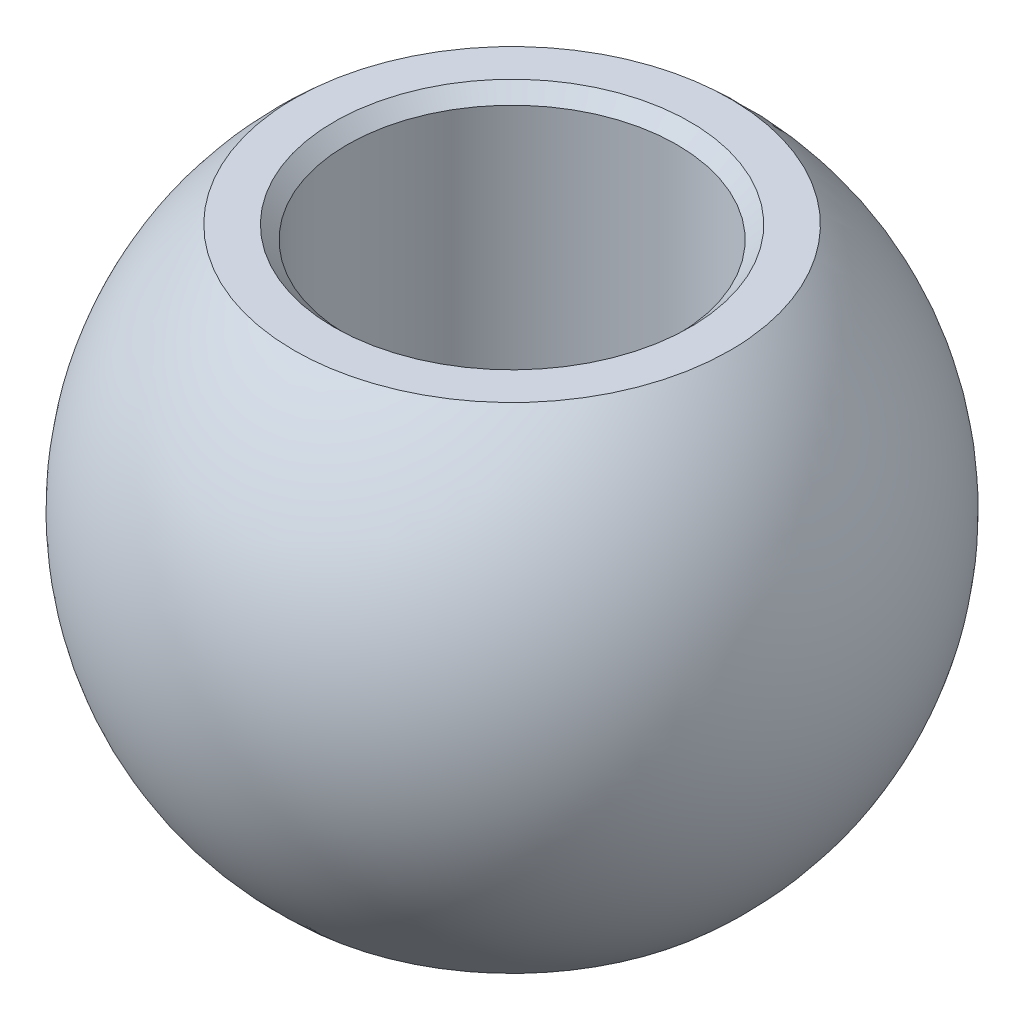
ISO-10303-21;
HEADER;
FILE_DESCRIPTION(('STEP AP214'),'2;1');
FILE_NAME('part.step','',(''),(''),'','','');
FILE_SCHEMA(('AUTOMOTIVE_DESIGN { 1 0 10303 214 1 1 1 1 }'));
ENDSEC;
DATA;
#1=APPLICATION_CONTEXT('core data for automotive mechanical design processes');
#2=APPLICATION_PROTOCOL_DEFINITION('international standard','automotive_design',2000,#1);
#3=PRODUCT_CONTEXT('',#1,'mechanical');
#4=PRODUCT('Part','Part','',(#3));
#5=PRODUCT_RELATED_PRODUCT_CATEGORY('part','',(#4));
#6=PRODUCT_DEFINITION_FORMATION('','',#4);
#7=PRODUCT_DEFINITION_CONTEXT('part definition',#1,'design');
#8=PRODUCT_DEFINITION('design','',#6,#7);
#9=PRODUCT_DEFINITION_SHAPE('','',#8);
#10=(LENGTH_UNIT() NAMED_UNIT(*) SI_UNIT(.MILLI.,.METRE.));
#11=(NAMED_UNIT(*) PLANE_ANGLE_UNIT() SI_UNIT($,.RADIAN.));
#12=(NAMED_UNIT(*) SI_UNIT($,.STERADIAN.) SOLID_ANGLE_UNIT());
#13=UNCERTAINTY_MEASURE_WITH_UNIT(LENGTH_MEASURE(1.E-05),#10,'distance_accuracy_value','');
#14=(GEOMETRIC_REPRESENTATION_CONTEXT(3) GLOBAL_UNCERTAINTY_ASSIGNED_CONTEXT((#13)) GLOBAL_UNIT_ASSIGNED_CONTEXT((#10,
#11,#12)) REPRESENTATION_CONTEXT('',''));
#15=CARTESIAN_POINT('',(0.,0.,0.));
#16=DIRECTION('',(0.,0.,1.));
#17=DIRECTION('',(1.,0.,0.));
#18=AXIS2_PLACEMENT_3D('',#15,#16,#17);
#19=CARTESIAN_POINT('',(0.,0.,39.6748));
#20=DIRECTION('',(0.,1.,0.));
#21=DIRECTION('',(0.,0.,1.));
#22=AXIS2_PLACEMENT_3D('',#19,#20,#21);
#23=CYLINDRICAL_SURFACE('',#22,3.175);
#24=CARTESIAN_POINT('',(0.,-4.50849999998582,39.6748));
#25=DIRECTION('',(0.,-1.,0.));
#26=DIRECTION('',(0.,0.,-1.));
#27=AXIS2_PLACEMENT_3D('',#24,#25,#26);
#28=CIRCLE('',#27,3.17499999994174);
#29=CARTESIAN_POINT('',(0.,-4.50849999998582,36.4998000000583));
#30=VERTEX_POINT('',#29);
#31=EDGE_CURVE('E55',#30,#30,#28,.T.);
#32=ORIENTED_EDGE('',*,*,#31,.T.);
#33=EDGE_LOOP('',(#32));
#34=FACE_BOUND('',#33,.T.);
#35=CARTESIAN_POINT('',(0.,4.50849999998582,39.6748));
#36=DIRECTION('',(0.,1.,0.));
#37=DIRECTION('',(0.,0.,-1.));
#38=AXIS2_PLACEMENT_3D('',#35,#36,#37);
#39=CIRCLE('',#38,3.17499999994174);
#40=CARTESIAN_POINT('',(0.,4.50849999998582,36.4998000000583));
#41=VERTEX_POINT('',#40);
#42=EDGE_CURVE('E52',#41,#41,#39,.T.);
#43=ORIENTED_EDGE('',*,*,#42,.T.);
#44=EDGE_LOOP('',(#43));
#45=FACE_BOUND('',#44,.T.);
#46=ADVANCED_FACE('F16',(#34,#45),#23,.F.);
#47=CARTESIAN_POINT('',(0.,-4.76250000014034,39.6748));
#48=DIRECTION('',(0.,-1.,0.));
#49=DIRECTION('',(1.,0.,0.));
#50=AXIS2_PLACEMENT_3D('',#47,#48,#49);
#51=CONICAL_SURFACE('',#50,3.42900000009626,0.785398163397448);
#52=ORIENTED_EDGE('',*,*,#31,.F.);
#53=EDGE_LOOP('',(#52));
#54=FACE_BOUND('',#53,.T.);
#55=CARTESIAN_POINT('',(0.,-4.76250000002665,39.6748));
#56=DIRECTION('',(0.,-1.,0.));
#57=DIRECTION('',(1.,0.,0.));
#58=AXIS2_PLACEMENT_3D('',#55,#56,#57);
#59=CIRCLE('',#58,3.42899999998257);
#60=CARTESIAN_POINT('',(3.42899999998257,-4.76250000002665,39.6748));
#61=VERTEX_POINT('',#60);
#62=EDGE_CURVE('E19',#61,#61,#59,.T.);
#63=ORIENTED_EDGE('',*,*,#62,.T.);
#64=EDGE_LOOP('',(#63));
#65=FACE_BOUND('',#64,.T.);
#66=ADVANCED_FACE('F69',(#54,#65),#51,.F.);
#67=CARTESIAN_POINT('',(0.,4.76250000014034,39.6748));
#68=DIRECTION('',(0.,1.,0.));
#69=DIRECTION('',(0.,0.,1.));
#70=AXIS2_PLACEMENT_3D('',#67,#68,#69);
#71=CONICAL_SURFACE('',#70,3.42900000009626,0.785398163397448);
#72=ORIENTED_EDGE('',*,*,#42,.F.);
#73=EDGE_LOOP('',(#72));
#74=FACE_BOUND('',#73,.T.);
#75=CARTESIAN_POINT('',(0.,4.76250000002665,39.6748));
#76=DIRECTION('',(0.,1.,0.));
#77=DIRECTION('',(0.,0.,1.));
#78=AXIS2_PLACEMENT_3D('',#75,#76,#77);
#79=CIRCLE('',#78,3.42899999998257);
#80=CARTESIAN_POINT('',(0.,4.76250000002665,43.1037999999826));
#81=VERTEX_POINT('',#80);
#82=EDGE_CURVE('E62',#81,#81,#79,.T.);
#83=ORIENTED_EDGE('',*,*,#82,.T.);
#84=EDGE_LOOP('',(#83));
#85=FACE_BOUND('',#84,.T.);
#86=ADVANCED_FACE('F66',(#74,#85),#71,.F.);
#87=CARTESIAN_POINT('',(0.,-4.7625,39.6748));
#88=DIRECTION('',(0.,1.,0.));
#89=DIRECTION('',(-1.,0.,0.));
#90=AXIS2_PLACEMENT_3D('',#87,#88,#89);
#91=PLANE('',#90);
#92=CARTESIAN_POINT('',(0.,-4.7625,35.474669793685));
#93=CARTESIAN_POINT('',(-0.117926484560648,-4.76249999999999,35.4746705003406));
#94=CARTESIAN_POINT('',(-0.235874641254157,-4.7625,35.4796407426249));
#95=CARTESIAN_POINT('',(-0.470955861004179,-4.7625,35.4994893992508));
#96=CARTESIAN_POINT('',(-0.588088673100279,-4.76249999999999,35.5143707387952));
#97=CARTESIAN_POINT('',(-0.820881455214078,-4.76250000000001,35.5539746348211));
#98=CARTESIAN_POINT('',(-0.936538785047825,-4.76250000000002,35.578712813112));
#99=CARTESIAN_POINT('',(-1.16542262835762,-4.76249999999998,35.6378598749722));
#100=CARTESIAN_POINT('',(-1.27864708861528,-4.76249999999992,35.6722766063815));
#101=CARTESIAN_POINT('',(-1.61297348901639,-4.76249999999987,35.7895687284957));
#102=CARTESIAN_POINT('',(-1.82929109201931,-4.7625,35.8865823893113));
#103=CARTESIAN_POINT('',(-2.24254482911471,-4.7625,36.1156012463159));
#104=CARTESIAN_POINT('',(-2.43948022604495,-4.76249999999986,36.2476077726817));
#105=CARTESIAN_POINT('',(-2.71606737206159,-4.76249999999991,36.4688554348013));
#106=CARTESIAN_POINT('',(-2.80517919807279,-4.76249999999998,36.5465360472166));
#107=CARTESIAN_POINT('',(-2.97648149360179,-4.76250000000002,36.7090689827918));
#108=CARTESIAN_POINT('',(-3.05867855351256,-4.76250000000001,36.7939143191315));
#109=CARTESIAN_POINT('',(-3.21566582479756,-4.76249999999999,36.9702602153388));
#110=CARTESIAN_POINT('',(-3.29045266406455,-4.7625,37.0617637725565));
#111=CARTESIAN_POINT('',(-3.43207083285623,-4.7625,37.2507683469001));
#112=CARTESIAN_POINT('',(-3.49890031578299,-4.7625,37.3482707481971));
#113=CARTESIAN_POINT('',(-3.62408488645374,-4.7625,37.5485259987615));
#114=CARTESIAN_POINT('',(-3.68244282868451,-4.7625,37.6512770636412));
#115=CARTESIAN_POINT('',(-3.79031685235154,-4.7625,37.8613661013462));
#116=CARTESIAN_POINT('',(-3.83982966775091,-4.7625,37.9687057504367));
#117=CARTESIAN_POINT('',(-3.92961805965568,-4.7625,38.1871414385288));
#118=CARTESIAN_POINT('',(-3.96989715669365,-4.7625,38.298236027288));
#119=CARTESIAN_POINT('',(-4.04096740989927,-4.7625,38.5234351936217));
#120=CARTESIAN_POINT('',(-4.07175500997035,-4.7625,38.637540881999));
#121=CARTESIAN_POINT('',(-4.14948264836218,-4.7625,38.9830616747164));
#122=CARTESIAN_POINT('',(-4.18188464233577,-4.7625,39.2179174453362));
#123=CARTESIAN_POINT('',(-4.20674194830698,-4.7625,39.6897335499569));
#124=CARTESIAN_POINT('',(-4.19919726030459,-4.7625,39.9266938839578));
#125=CARTESIAN_POINT('',(-4.15820619108129,-4.7625,40.2784692898831));
#126=CARTESIAN_POINT('',(-4.13957890770972,-4.7625,40.3951783673039));
#127=CARTESIAN_POINT('',(-4.09256533770935,-4.7625,40.6265986983984));
#128=CARTESIAN_POINT('',(-4.06418270421069,-4.7625,40.741310683062));
#129=CARTESIAN_POINT('',(-3.9978439316288,-4.7625,40.9679718231047));
#130=CARTESIAN_POINT('',(-3.95988413911528,-4.7625,41.0799199061967));
#131=CARTESIAN_POINT('',(-3.87468281446519,-4.7625,41.3001809854272));
#132=CARTESIAN_POINT('',(-3.8274447064219,-4.7625,41.408495305366));
#133=CARTESIAN_POINT('',(-3.72399535984847,-4.7625,41.6207959761284));
#134=CARTESIAN_POINT('',(-3.66778109513567,-4.7625,41.7247808523832));
#135=CARTESIAN_POINT('',(-3.54680693840993,-4.7625,41.9276199222372));
#136=CARTESIAN_POINT('',(-3.4820490282168,-4.7625,42.0264752983098));
#137=CARTESIAN_POINT('',(-3.34446071544949,-4.7625,42.2183407059385));
#138=CARTESIAN_POINT('',(-3.2716339812673,-4.7625,42.3113533639208));
#139=CARTESIAN_POINT('',(-3.11835846692699,-4.7625,42.4909864574862));
#140=CARTESIAN_POINT('',(-3.03790239870583,-4.7625,42.5776006374261));
#141=CARTESIAN_POINT('',(-2.78609444631246,-4.76250000000001,42.8266864307715));
#142=CARTESIAN_POINT('',(-2.60412011062188,-4.7625,42.9786555549948));
#143=CARTESIAN_POINT('',(-2.21721871431334,-4.7625,43.2498300331846));
#144=CARTESIAN_POINT('',(-2.01229252654771,-4.7625,43.3690366325053));
#145=CARTESIAN_POINT('',(-1.69214162632159,-4.7625,43.5208094396865));
#146=CARTESIAN_POINT('',(-1.58316037186445,-4.7625,43.5669329258782));
#147=CARTESIAN_POINT('',(-1.36175860205062,-4.7625,43.6498029746188));
#148=CARTESIAN_POINT('',(-1.2493409531731,-4.7625,43.6865571258167));
#149=CARTESIAN_POINT('',(-1.02199834753082,-4.7625,43.7504029373041));
#150=CARTESIAN_POINT('',(-0.907077657826514,-4.7625,43.7775098554997));
#151=CARTESIAN_POINT('',(-0.675383462532599,-4.7625,43.821950252844));
#152=CARTESIAN_POINT('',(-0.558610513885534,-4.7625,43.8392866146316));
#153=CARTESIAN_POINT('',(-0.368047147367473,-4.7625,43.8594230565356));
#154=CARTESIAN_POINT('',(-0.294561834944463,-4.7625,43.8652363974709));
#155=CARTESIAN_POINT('',(-0.147387169762454,-4.7625,43.8729901931718));
#156=CARTESIAN_POINT('',(-0.0736978170034557,-4.7625,43.8749306479375));
#157=CARTESIAN_POINT('',(0.117926484560645,-4.7625,43.8749294996594));
#158=CARTESIAN_POINT('',(0.235874641254155,-4.7625,43.8699592573751));
#159=CARTESIAN_POINT('',(0.470955861004177,-4.7625,43.8501106007492));
#160=CARTESIAN_POINT('',(0.588088673100276,-4.76249999999999,43.8352292612048));
#161=CARTESIAN_POINT('',(0.820881455214074,-4.76250000000001,43.7956253651789));
#162=CARTESIAN_POINT('',(0.936538785047819,-4.76250000000002,43.770887186888));
#163=CARTESIAN_POINT('',(1.16542262835762,-4.76249999999998,43.7117401250278));
#164=CARTESIAN_POINT('',(1.27864708861528,-4.76249999999992,43.6773233936185));
#165=CARTESIAN_POINT('',(1.61297348901639,-4.76249999999987,43.5600312715043));
#166=CARTESIAN_POINT('',(1.8292910920193,-4.7625,43.4630176106887));
#167=CARTESIAN_POINT('',(2.2425448291147,-4.7625,43.2339987536841));
#168=CARTESIAN_POINT('',(2.43948022604494,-4.76249999999987,43.1019922273183));
#169=CARTESIAN_POINT('',(2.71606737206159,-4.76249999999992,42.8807445651986));
#170=CARTESIAN_POINT('',(2.8051791980728,-4.76249999999998,42.8030639527834));
#171=CARTESIAN_POINT('',(2.97648149360179,-4.76250000000002,42.6405310172082));
#172=CARTESIAN_POINT('',(3.05867855351256,-4.76250000000001,42.5556856808685));
#173=CARTESIAN_POINT('',(3.21566582479755,-4.76249999999999,42.3793397846612));
#174=CARTESIAN_POINT('',(3.29045266406455,-4.7625,42.2878362274435));
#175=CARTESIAN_POINT('',(3.43207083285622,-4.7625,42.0988316530999));
#176=CARTESIAN_POINT('',(3.49890031578299,-4.7625,42.0013292518029));
#177=CARTESIAN_POINT('',(3.62408488645374,-4.7625,41.8010740012385));
#178=CARTESIAN_POINT('',(3.68244282868451,-4.7625,41.6983229363588));
#179=CARTESIAN_POINT('',(3.79031685235154,-4.7625,41.4882338986538));
#180=CARTESIAN_POINT('',(3.8398296677509,-4.7625,41.3808942495633));
#181=CARTESIAN_POINT('',(3.92961805965568,-4.7625,41.1624585614712));
#182=CARTESIAN_POINT('',(3.96989715669365,-4.7625,41.051363972712));
#183=CARTESIAN_POINT('',(4.04096740989927,-4.7625,40.8261648063783));
#184=CARTESIAN_POINT('',(4.07175500997035,-4.7625,40.712059118001));
#185=CARTESIAN_POINT('',(4.14948264836218,-4.7625,40.3665383252836));
#186=CARTESIAN_POINT('',(4.18188464233577,-4.7625,40.1316825546638));
#187=CARTESIAN_POINT('',(4.20674194830697,-4.7625,39.6598664500431));
#188=CARTESIAN_POINT('',(4.19919726030459,-4.7625,39.4229061160422));
#189=CARTESIAN_POINT('',(4.15820619108129,-4.7625,39.0711307101168));
#190=CARTESIAN_POINT('',(4.13957890770973,-4.7625,38.9544216326961));
#191=CARTESIAN_POINT('',(4.09256533770935,-4.7625,38.7230013016016));
#192=CARTESIAN_POINT('',(4.06418270421069,-4.7625,38.608289316938));
#193=CARTESIAN_POINT('',(3.9978439316288,-4.7625,38.3816281768953));
#194=CARTESIAN_POINT('',(3.95988413911527,-4.7625,38.2696800938033));
#195=CARTESIAN_POINT('',(3.87468281446518,-4.7625,38.0494190145728));
#196=CARTESIAN_POINT('',(3.8274447064219,-4.7625,37.941104694634));
#197=CARTESIAN_POINT('',(3.72399535984847,-4.7625,37.7288040238715));
#198=CARTESIAN_POINT('',(3.66778109513566,-4.7625,37.6248191476168));
#199=CARTESIAN_POINT('',(3.54680693840993,-4.7625,37.4219800777628));
#200=CARTESIAN_POINT('',(3.48204902821679,-4.7625,37.3231247016902));
#201=CARTESIAN_POINT('',(3.34446071544948,-4.7625,37.1312592940615));
#202=CARTESIAN_POINT('',(3.2716339812673,-4.7625,37.0382466360792));
#203=CARTESIAN_POINT('',(3.11835846692699,-4.7625,36.8586135425138));
#204=CARTESIAN_POINT('',(3.03790239870582,-4.7625,36.7719993625739));
#205=CARTESIAN_POINT('',(2.78609444631245,-4.7625,36.5229135692285));
#206=CARTESIAN_POINT('',(2.60412011062188,-4.7625,36.3709444450052));
#207=CARTESIAN_POINT('',(2.21721871431334,-4.7625,36.0997699668154));
#208=CARTESIAN_POINT('',(2.0122925265477,-4.7625,35.9805633674946));
#209=CARTESIAN_POINT('',(1.69214162632159,-4.7625,35.8287905603135));
#210=CARTESIAN_POINT('',(1.58316037186444,-4.7625,35.7826670741218));
#211=CARTESIAN_POINT('',(1.36175860205061,-4.7625,35.6997970253812));
#212=CARTESIAN_POINT('',(1.2493409531731,-4.7625,35.6630428741833));
#213=CARTESIAN_POINT('',(1.02199834753082,-4.7625,35.5991970626959));
#214=CARTESIAN_POINT('',(0.907077657826514,-4.7625,35.5720901445003));
#215=CARTESIAN_POINT('',(0.6753834625326,-4.7625,35.527649747156));
#216=CARTESIAN_POINT('',(0.558610513885536,-4.7625,35.5103133853683));
#217=CARTESIAN_POINT('',(0.368047147367474,-4.7625,35.4901769434644));
#218=CARTESIAN_POINT('',(0.294561834944463,-4.7625,35.4843636025291));
#219=CARTESIAN_POINT('',(0.147387169762453,-4.7625,35.4766098068282));
#220=CARTESIAN_POINT('',(0.0736978170034544,-4.7625,35.4746693520625));
#221=CARTESIAN_POINT('',(0.,-4.7625,35.474669793685));
#222=B_SPLINE_CURVE_WITH_KNOTS('',3,(#92,#93,#94,#95,#96,#97,#98,#99,#100,#101,#102,#103,#104,
#105,#106,#107,#108,#109,#110,#111,#112,#113,#114,#115,#116,#117,#118,#119,#120,#121,#122,#123,
#124,#125,#126,#127,#128,#129,#130,#131,#132,#133,#134,#135,#136,#137,#138,#139,#140,#141,#142,
#143,#144,#145,#146,#147,#148,#149,#150,#151,#152,#153,#154,#155,#156,#157,#158,#159,#160,#161,
#162,#163,#164,#165,#166,#167,#168,#169,#170,#171,#172,#173,#174,#175,#176,#177,#178,#179,#180,
#181,#182,#183,#184,#185,#186,#187,#188,#189,#190,#191,#192,#193,#194,#195,#196,#197,#198,#199,
#200,#201,#202,#203,#204,#205,#206,#207,#208,#209,#210,#211,#212,#213,#214,#215,#216,#217,#218,
#219,#220,#221),.UNSPECIFIED.,.T.,.F.,(4,2,2,2,2,2,2,2,2,2,2,2,2,2,2,2,2,2,2,2,2,2,2,2,2,2,2,2,
2,2,2,2,2,2,2,2,2,2,2,2,2,2,2,2,2,2,2,2,2,2,2,2,2,2,2,2,2,2,2,2,2,2,2,2,4),(0.,
0.353711607909458,0.707527658036068,1.0619067054432,1.41657393321626,2.12421773198893,
2.83188843414218,3.1861874417149,3.54014485168142,3.89426260138645,4.24846236876854,
4.60254251007931,4.95675312540428,5.31082846567946,5.66503630351361,6.37269355397748,
7.08035080444135,7.43455864227549,7.78863398255066,8.14284459787563,8.4969247391864,
8.85112450656849,9.20524225627352,9.55919966624004,9.91349867381277,10.621169375966,
11.3288131747387,11.6834804025117,12.0378594499189,12.3916755000455,12.745387107955,
12.9664381589451,13.1874892099353,13.5412008178448,13.8950168679714,14.2493959153785,
14.6040631431516,15.3117069419242,16.0193776440775,16.3736766516502,16.7276340616168,
17.0817518113218,17.4359515787039,17.7900317200146,18.1442423353396,18.4983176756148,
18.8525255134489,19.5601827639128,20.2678400143767,20.6220478522108,20.976123192486,
21.330333807811,21.6844139491217,22.0386137165038,22.3927314662088,22.7466888761754,
23.1009878837481,23.8086585859014,24.516302384674,24.8709696124471,25.2253486598542,
25.5791647099808,25.9328763178903,26.1539273688805,26.3749784198707),.UNSPECIFIED.);
#223=CARTESIAN_POINT('',(0.,-4.7625,35.474669793685));
#224=VERTEX_POINT('',#223);
#225=EDGE_CURVE('E25',#224,#224,#222,.T.);
#226=ORIENTED_EDGE('',*,*,#225,.F.);
#227=EDGE_LOOP('',(#226));
#228=FACE_BOUND('',#227,.T.);
#229=ORIENTED_EDGE('',*,*,#62,.F.);
#230=EDGE_LOOP('',(#229));
#231=FACE_BOUND('',#230,.T.);
#232=ADVANCED_FACE('F40',(#228,#231),#91,.F.);
#233=CARTESIAN_POINT('',(0.,4.7625,39.6748));
#234=DIRECTION('',(0.,-1.,0.));
#235=DIRECTION('',(0.,0.,-1.));
#236=AXIS2_PLACEMENT_3D('',#233,#234,#235);
#237=PLANE('',#236);
#238=CARTESIAN_POINT('',(0.,4.7625,43.874930206315));
#239=CARTESIAN_POINT('',(-0.117926484560646,4.7625,43.8749294996594));
#240=CARTESIAN_POINT('',(-0.235874641254156,4.7625,43.8699592573751));
#241=CARTESIAN_POINT('',(-0.470955861004178,4.7625,43.8501106007492));
#242=CARTESIAN_POINT('',(-0.588088673100278,4.76249999999999,43.8352292612048));
#243=CARTESIAN_POINT('',(-0.820881455214076,4.76250000000001,43.7956253651789));
#244=CARTESIAN_POINT('',(-0.936538785047821,4.76250000000002,43.770887186888));
#245=CARTESIAN_POINT('',(-1.16542262835762,4.76249999999998,43.7117401250278));
#246=CARTESIAN_POINT('',(-1.27864708861528,4.76249999999992,43.6773233936185));
#247=CARTESIAN_POINT('',(-1.61297348901639,4.76249999999987,43.5600312715043));
#248=CARTESIAN_POINT('',(-1.8292910920193,4.7625,43.4630176106887));
#249=CARTESIAN_POINT('',(-2.2425448291147,4.7625,43.2339987536841));
#250=CARTESIAN_POINT('',(-2.43948022604495,4.76249999999986,43.1019922273183));
#251=CARTESIAN_POINT('',(-2.71606737206159,4.76249999999992,42.8807445651986));
#252=CARTESIAN_POINT('',(-2.80517919807279,4.76249999999998,42.8030639527834));
#253=CARTESIAN_POINT('',(-2.97648149360178,4.76250000000002,42.6405310172082));
#254=CARTESIAN_POINT('',(-3.05867855351256,4.76250000000001,42.5556856808685));
#255=CARTESIAN_POINT('',(-3.21566582479756,4.76249999999999,42.3793397846612));
#256=CARTESIAN_POINT('',(-3.29045266406455,4.7625,42.2878362274435));
#257=CARTESIAN_POINT('',(-3.43207083285622,4.7625,42.0988316530999));
#258=CARTESIAN_POINT('',(-3.49890031578299,4.7625,42.0013292518029));
#259=CARTESIAN_POINT('',(-3.62408488645374,4.7625,41.8010740012385));
#260=CARTESIAN_POINT('',(-3.68244282868451,4.7625,41.6983229363588));
#261=CARTESIAN_POINT('',(-3.79031685235154,4.7625,41.4882338986538));
#262=CARTESIAN_POINT('',(-3.8398296677509,4.7625,41.3808942495633));
#263=CARTESIAN_POINT('',(-3.92961805965568,4.7625,41.1624585614712));
#264=CARTESIAN_POINT('',(-3.96989715669365,4.7625,41.051363972712));
#265=CARTESIAN_POINT('',(-4.04096740989927,4.7625,40.8261648063783));
#266=CARTESIAN_POINT('',(-4.07175500997035,4.7625,40.712059118001));
#267=CARTESIAN_POINT('',(-4.14948264836218,4.7625,40.3665383252836));
#268=CARTESIAN_POINT('',(-4.18188464233577,4.7625,40.1316825546638));
#269=CARTESIAN_POINT('',(-4.20674194830698,4.7625,39.6598664500431));
#270=CARTESIAN_POINT('',(-4.19919726030459,4.7625,39.4229061160422));
#271=CARTESIAN_POINT('',(-4.15820619108129,4.7625,39.0711307101168));
#272=CARTESIAN_POINT('',(-4.13957890770972,4.7625,38.9544216326961));
#273=CARTESIAN_POINT('',(-4.09256533770935,4.7625,38.7230013016016));
#274=CARTESIAN_POINT('',(-4.06418270421069,4.7625,38.608289316938));
#275=CARTESIAN_POINT('',(-3.9978439316288,4.7625,38.3816281768953));
#276=CARTESIAN_POINT('',(-3.95988413911527,4.7625,38.2696800938033));
#277=CARTESIAN_POINT('',(-3.87468281446519,4.7625,38.0494190145728));
#278=CARTESIAN_POINT('',(-3.8274447064219,4.76250000000001,37.941104694634));
#279=CARTESIAN_POINT('',(-3.72399535984847,4.76250000000001,37.7288040238715));
#280=CARTESIAN_POINT('',(-3.66778109513566,4.7625,37.6248191476168));
#281=CARTESIAN_POINT('',(-3.54680693840993,4.7625,37.4219800777628));
#282=CARTESIAN_POINT('',(-3.4820490282168,4.7625,37.3231247016902));
#283=CARTESIAN_POINT('',(-3.34446071544948,4.7625,37.1312592940615));
#284=CARTESIAN_POINT('',(-3.2716339812673,4.7625,37.0382466360792));
#285=CARTESIAN_POINT('',(-3.11835846692699,4.7625,36.8586135425138));
#286=CARTESIAN_POINT('',(-3.03790239870583,4.7625,36.7719993625739));
#287=CARTESIAN_POINT('',(-2.78609444631246,4.7625,36.5229135692285));
#288=CARTESIAN_POINT('',(-2.60412011062188,4.7625,36.3709444450052));
#289=CARTESIAN_POINT('',(-2.21721871431334,4.7625,36.0997699668154));
#290=CARTESIAN_POINT('',(-2.0122925265477,4.7625,35.9805633674946));
#291=CARTESIAN_POINT('',(-1.69214162632159,4.7625,35.8287905603135));
#292=CARTESIAN_POINT('',(-1.58316037186444,4.7625,35.7826670741218));
#293=CARTESIAN_POINT('',(-1.36175860205061,4.7625,35.6997970253812));
#294=CARTESIAN_POINT('',(-1.2493409531731,4.7625,35.6630428741833));
#295=CARTESIAN_POINT('',(-1.02199834753081,4.7625,35.5991970626959));
#296=CARTESIAN_POINT('',(-0.907077657826513,4.7625,35.5720901445003));
#297=CARTESIAN_POINT('',(-0.675383462532598,4.7625,35.527649747156));
#298=CARTESIAN_POINT('',(-0.558610513885534,4.7625,35.5103133853683));
#299=CARTESIAN_POINT('',(-0.368047147367472,4.7625,35.4901769434644));
#300=CARTESIAN_POINT('',(-0.294561834944462,4.7625,35.4843636025291));
#301=CARTESIAN_POINT('',(-0.147387169762453,4.7625,35.4766098068282));
#302=CARTESIAN_POINT('',(-0.0736978170034545,4.7625,35.4746693520625));
#303=CARTESIAN_POINT('',(0.117926484560647,4.7625,35.4746705003406));
#304=CARTESIAN_POINT('',(0.235874641254156,4.7625,35.4796407426249));
#305=CARTESIAN_POINT('',(0.470955861004179,4.7625,35.4994893992508));
#306=CARTESIAN_POINT('',(0.588088673100278,4.76249999999999,35.5143707387952));
#307=CARTESIAN_POINT('',(0.820881455214076,4.76250000000001,35.5539746348211));
#308=CARTESIAN_POINT('',(0.936538785047822,4.76250000000002,35.578712813112));
#309=CARTESIAN_POINT('',(1.16542262835762,4.76249999999998,35.6378598749722));
#310=CARTESIAN_POINT('',(1.27864708861528,4.76249999999992,35.6722766063815));
#311=CARTESIAN_POINT('',(1.61297348901639,4.76249999999987,35.7895687284957));
#312=CARTESIAN_POINT('',(1.8292910920193,4.7625,35.8865823893113));
#313=CARTESIAN_POINT('',(2.2425448291147,4.7625,36.1156012463159));
#314=CARTESIAN_POINT('',(2.43948022604495,4.76249999999986,36.2476077726817));
#315=CARTESIAN_POINT('',(2.71606737206159,4.76249999999992,36.4688554348013));
#316=CARTESIAN_POINT('',(2.80517919807279,4.76249999999998,36.5465360472166));
#317=CARTESIAN_POINT('',(2.97648149360179,4.76250000000002,36.7090689827918));
#318=CARTESIAN_POINT('',(3.05867855351256,4.76250000000001,36.7939143191315));
#319=CARTESIAN_POINT('',(3.21566582479756,4.76249999999999,36.9702602153388));
#320=CARTESIAN_POINT('',(3.29045266406455,4.7625,37.0617637725565));
#321=CARTESIAN_POINT('',(3.43207083285622,4.7625,37.2507683469001));
#322=CARTESIAN_POINT('',(3.49890031578299,4.7625,37.3482707481971));
#323=CARTESIAN_POINT('',(3.62408488645374,4.7625,37.5485259987615));
#324=CARTESIAN_POINT('',(3.68244282868451,4.7625,37.6512770636412));
#325=CARTESIAN_POINT('',(3.79031685235154,4.7625,37.8613661013462));
#326=CARTESIAN_POINT('',(3.8398296677509,4.7625,37.9687057504367));
#327=CARTESIAN_POINT('',(3.92961805965568,4.7625,38.1871414385288));
#328=CARTESIAN_POINT('',(3.96989715669365,4.7625,38.298236027288));
#329=CARTESIAN_POINT('',(4.04096740989927,4.7625,38.5234351936217));
#330=CARTESIAN_POINT('',(4.07175500997035,4.7625,38.637540881999));
#331=CARTESIAN_POINT('',(4.14948264836218,4.7625,38.9830616747164));
#332=CARTESIAN_POINT('',(4.18188464233577,4.7625,39.2179174453362));
#333=CARTESIAN_POINT('',(4.20674194830697,4.7625,39.6897335499569));
#334=CARTESIAN_POINT('',(4.19919726030459,4.7625,39.9266938839578));
#335=CARTESIAN_POINT('',(4.15820619108129,4.7625,40.2784692898831));
#336=CARTESIAN_POINT('',(4.13957890770972,4.7625,40.3951783673039));
#337=CARTESIAN_POINT('',(4.09256533770935,4.7625,40.6265986983984));
#338=CARTESIAN_POINT('',(4.06418270421069,4.7625,40.741310683062));
#339=CARTESIAN_POINT('',(3.9978439316288,4.7625,40.9679718231047));
#340=CARTESIAN_POINT('',(3.95988413911528,4.7625,41.0799199061967));
#341=CARTESIAN_POINT('',(3.87468281446519,4.7625,41.3001809854272));
#342=CARTESIAN_POINT('',(3.8274447064219,4.7625,41.408495305366));
#343=CARTESIAN_POINT('',(3.72399535984847,4.7625,41.6207959761284));
#344=CARTESIAN_POINT('',(3.66778109513566,4.7625,41.7247808523832));
#345=CARTESIAN_POINT('',(3.54680693840993,4.7625,41.9276199222372));
#346=CARTESIAN_POINT('',(3.48204902821679,4.7625,42.0264752983098));
#347=CARTESIAN_POINT('',(3.34446071544948,4.7625,42.2183407059385));
#348=CARTESIAN_POINT('',(3.2716339812673,4.7625,42.3113533639208));
#349=CARTESIAN_POINT('',(3.11835846692699,4.7625,42.4909864574862));
#350=CARTESIAN_POINT('',(3.03790239870583,4.7625,42.5776006374261));
#351=CARTESIAN_POINT('',(2.78609444631246,4.7625,42.8266864307715));
#352=CARTESIAN_POINT('',(2.60412011062188,4.7625,42.9786555549948));
#353=CARTESIAN_POINT('',(2.21721871431334,4.7625,43.2498300331846));
#354=CARTESIAN_POINT('',(2.0122925265477,4.7625,43.3690366325054));
#355=CARTESIAN_POINT('',(1.69214162632159,4.7625,43.5208094396865));
#356=CARTESIAN_POINT('',(1.58316037186444,4.7625,43.5669329258782));
#357=CARTESIAN_POINT('',(1.36175860205061,4.7625,43.6498029746188));
#358=CARTESIAN_POINT('',(1.2493409531731,4.7625,43.6865571258167));
#359=CARTESIAN_POINT('',(1.02199834753082,4.7625,43.7504029373041));
#360=CARTESIAN_POINT('',(0.907077657826517,4.7625,43.7775098554997));
#361=CARTESIAN_POINT('',(0.675383462532602,4.7625,43.821950252844));
#362=CARTESIAN_POINT('',(0.558610513885537,4.7625,43.8392866146316));
#363=CARTESIAN_POINT('',(0.368047147367476,4.7625,43.8594230565356));
#364=CARTESIAN_POINT('',(0.294561834944465,4.7625,43.8652363974709));
#365=CARTESIAN_POINT('',(0.147387169762455,4.7625,43.8729901931718));
#366=CARTESIAN_POINT('',(0.0736978170034558,4.7625,43.8749306479375));
#367=CARTESIAN_POINT('',(0.,4.7625,43.874930206315));
#368=B_SPLINE_CURVE_WITH_KNOTS('',3,(#238,#239,#240,#241,#242,#243,#244,#245,#246,#247,#248,
#249,#250,#251,#252,#253,#254,#255,#256,#257,#258,#259,#260,#261,#262,#263,#264,#265,#266,#267,
#268,#269,#270,#271,#272,#273,#274,#275,#276,#277,#278,#279,#280,#281,#282,#283,#284,#285,#286,
#287,#288,#289,#290,#291,#292,#293,#294,#295,#296,#297,#298,#299,#300,#301,#302,#303,#304,#305,
#306,#307,#308,#309,#310,#311,#312,#313,#314,#315,#316,#317,#318,#319,#320,#321,#322,#323,#324,
#325,#326,#327,#328,#329,#330,#331,#332,#333,#334,#335,#336,#337,#338,#339,#340,#341,#342,#343,
#344,#345,#346,#347,#348,#349,#350,#351,#352,#353,#354,#355,#356,#357,#358,#359,#360,#361,#362,
#363,#364,#365,#366,#367),.UNSPECIFIED.,.T.,.F.,(4,2,2,2,2,2,2,2,2,2,2,2,2,2,2,2,2,2,2,2,2,2,2,
2,2,2,2,2,2,2,2,2,2,2,2,2,2,2,2,2,2,2,2,2,2,2,2,2,2,2,2,2,2,2,2,2,2,2,2,2,2,2,2,2,4),(0.,
0.353711607909459,0.707527658036068,1.06190670544319,1.41657393321626,2.12421773198892,
2.83188843414218,3.1861874417149,3.54014485168142,3.89426260138645,4.24846236876854,
4.6025425100793,4.95675312540428,5.31082846567946,5.66503630351361,6.37269355397748,
7.08035080444135,7.4345586422755,7.78863398255066,8.14284459787563,8.49692473918641,
8.8511245065685,9.20524225627353,9.55919966624004,9.91349867381277,10.621169375966,
11.3288131747387,11.6834804025118,12.0378594499189,12.3916755000455,12.745387107955,
12.9664381589451,13.1874892099353,13.5412008178448,13.8950168679714,14.2493959153785,
14.6040631431516,15.3117069419243,16.0193776440775,16.3736766516502,16.7276340616168,
17.0817518113218,17.4359515787039,17.7900317200146,18.1442423353396,18.4983176756148,
18.8525255134489,19.5601827639128,20.2678400143767,20.6220478522108,20.976123192486,
21.330333807811,21.6844139491217,22.0386137165038,22.3927314662089,22.7466888761754,
23.1009878837481,23.8086585859014,24.516302384674,24.8709696124471,25.2253486598542,
25.5791647099808,25.9328763178903,26.1539273688805,26.3749784198707),.UNSPECIFIED.);
#369=CARTESIAN_POINT('',(0.,4.7625,43.874930206315));
#370=VERTEX_POINT('',#369);
#371=EDGE_CURVE('E11',#370,#370,#368,.T.);
#372=ORIENTED_EDGE('',*,*,#371,.F.);
#373=EDGE_LOOP('',(#372));
#374=FACE_BOUND('',#373,.T.);
#375=ORIENTED_EDGE('',*,*,#82,.F.);
#376=EDGE_LOOP('',(#375));
#377=FACE_BOUND('',#376,.T.);
#378=ADVANCED_FACE('F33',(#374,#377),#237,.F.);
#379=CARTESIAN_POINT('',(0.,0.,39.6748));
#380=DIRECTION('',(1.,0.,0.));
#381=DIRECTION('',(0.,1.,0.));
#382=AXIS2_PLACEMENT_3D('',#379,#380,#381);
#383=SPHERICAL_SURFACE('',#382,6.35);
#384=ORIENTED_EDGE('',*,*,#225,.T.);
#385=EDGE_LOOP('',(#384));
#386=FACE_BOUND('',#385,.T.);
#387=ORIENTED_EDGE('',*,*,#371,.T.);
#388=EDGE_LOOP('',(#387));
#389=FACE_BOUND('',#388,.T.);
#390=CARTESIAN_POINT('',(-6.35,0.,39.6748));
#391=VERTEX_POINT('',#390);
#392=VERTEX_LOOP('',#391);
#393=FACE_BOUND('',#392,.T.);
#394=CARTESIAN_POINT('',(6.35,0.,39.6748));
#395=VERTEX_POINT('',#394);
#396=VERTEX_LOOP('',#395);
#397=FACE_BOUND('',#396,.T.);
#398=ADVANCED_FACE('F31',(#386,#389,#393,#397),#383,.T.);
#399=CLOSED_SHELL('',(#46,#66,#86,#232,#378,#398));
#400=MANIFOLD_SOLID_BREP('B1',#399);
#401=ADVANCED_BREP_SHAPE_REPRESENTATION('',(#18,#400),#14);
#402=SHAPE_DEFINITION_REPRESENTATION(#9,#401);
ENDSEC;
END-ISO-10303-21;
